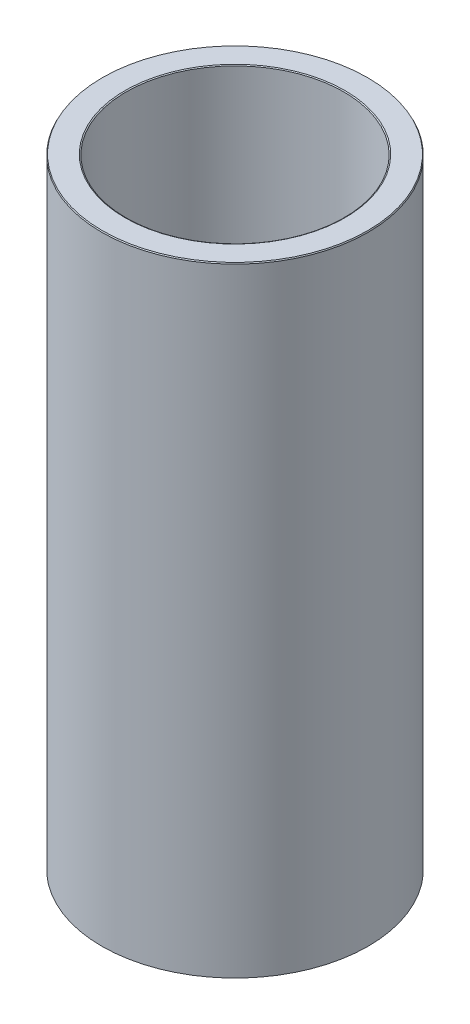
ISO-10303-21;
HEADER;
FILE_DESCRIPTION(('STEP AP214'),'2;1');
FILE_NAME('part.step','',(''),(''),'','','');
FILE_SCHEMA(('AUTOMOTIVE_DESIGN { 1 0 10303 214 1 1 1 1 }'));
ENDSEC;
DATA;
#1=APPLICATION_CONTEXT('core data for automotive mechanical design processes');
#2=APPLICATION_PROTOCOL_DEFINITION('international standard','automotive_design',2000,#1);
#3=PRODUCT_CONTEXT('',#1,'mechanical');
#4=PRODUCT('Part','Part','',(#3));
#5=PRODUCT_RELATED_PRODUCT_CATEGORY('part','',(#4));
#6=PRODUCT_DEFINITION_FORMATION('','',#4);
#7=PRODUCT_DEFINITION_CONTEXT('part definition',#1,'design');
#8=PRODUCT_DEFINITION('design','',#6,#7);
#9=PRODUCT_DEFINITION_SHAPE('','',#8);
#10=(LENGTH_UNIT() NAMED_UNIT(*) SI_UNIT(.MILLI.,.METRE.));
#11=(NAMED_UNIT(*) PLANE_ANGLE_UNIT() SI_UNIT($,.RADIAN.));
#12=(NAMED_UNIT(*) SI_UNIT($,.STERADIAN.) SOLID_ANGLE_UNIT());
#13=UNCERTAINTY_MEASURE_WITH_UNIT(LENGTH_MEASURE(1.E-05),#10,'distance_accuracy_value','');
#14=(GEOMETRIC_REPRESENTATION_CONTEXT(3) GLOBAL_UNCERTAINTY_ASSIGNED_CONTEXT((#13)) GLOBAL_UNIT_ASSIGNED_CONTEXT((#10,
#11,#12)) REPRESENTATION_CONTEXT('',''));
#15=CARTESIAN_POINT('',(0.,0.,0.));
#16=DIRECTION('',(0.,0.,1.));
#17=DIRECTION('',(1.,0.,0.));
#18=AXIS2_PLACEMENT_3D('',#15,#16,#17);
#19=CARTESIAN_POINT('',(0.,162.881200185796,0.));
#20=DIRECTION('',(0.,-1.,0.));
#21=DIRECTION('',(0.,0.,-1.));
#22=AXIS2_PLACEMENT_3D('',#19,#20,#21);
#23=CYLINDRICAL_SURFACE('',#22,35.);
#24=CARTESIAN_POINT('',(0.,0.167708947853312,0.));
#25=DIRECTION('',(0.,1.,0.));
#26=DIRECTION('',(0.,0.,1.));
#27=AXIS2_PLACEMENT_3D('',#24,#25,#26);
#28=CIRCLE('',#27,35.);
#29=CARTESIAN_POINT('',(0.,0.167708947853312,35.));
#30=VERTEX_POINT('',#29);
#31=EDGE_CURVE('E10',#30,#30,#28,.T.);
#32=ORIENTED_EDGE('',*,*,#31,.T.);
#33=EDGE_LOOP('',(#32));
#34=FACE_BOUND('',#33,.T.);
#35=CARTESIAN_POINT('',(0.,162.593699145272,0.));
#36=DIRECTION('',(0.,1.,0.));
#37=DIRECTION('',(0.,0.,1.));
#38=AXIS2_PLACEMENT_3D('',#35,#36,#37);
#39=CIRCLE('',#38,35.);
#40=CARTESIAN_POINT('',(0.,162.593699145272,35.));
#41=VERTEX_POINT('',#40);
#42=EDGE_CURVE('E50',#41,#41,#39,.F.);
#43=ORIENTED_EDGE('',*,*,#42,.T.);
#44=EDGE_LOOP('',(#43));
#45=FACE_BOUND('',#44,.T.);
#46=ADVANCED_FACE('F39',(#34,#45),#23,.T.);
#47=CARTESIAN_POINT('',(0.,162.881200185796,0.));
#48=DIRECTION('',(0.,1.,0.));
#49=DIRECTION('',(0.,0.,1.));
#50=AXIS2_PLACEMENT_3D('',#47,#48,#49);
#51=PLANE('',#50);
#52=CARTESIAN_POINT('',(0.,162.881200185796,0.));
#53=DIRECTION('',(0.,1.,0.));
#54=DIRECTION('',(0.,0.,1.));
#55=AXIS2_PLACEMENT_3D('',#52,#53,#54);
#56=CIRCLE('',#55,28.9256438677759);
#57=CARTESIAN_POINT('',(0.,162.881200185796,28.9256438677759));
#58=VERTEX_POINT('',#57);
#59=EDGE_CURVE('E58',#58,#58,#56,.F.);
#60=ORIENTED_EDGE('',*,*,#59,.T.);
#61=EDGE_LOOP('',(#60));
#62=FACE_BOUND('',#61,.T.);
#63=CARTESIAN_POINT('',(0.,162.881200185796,0.));
#64=DIRECTION('',(0.,1.,0.));
#65=DIRECTION('',(0.,0.,1.));
#66=AXIS2_PLACEMENT_3D('',#63,#64,#65);
#67=CIRCLE('',#66,34.8322910521467);
#68=CARTESIAN_POINT('',(0.,162.881200185796,34.8322910521467));
#69=VERTEX_POINT('',#68);
#70=EDGE_CURVE('E61',#69,#69,#67,.T.);
#71=ORIENTED_EDGE('',*,*,#70,.T.);
#72=EDGE_LOOP('',(#71));
#73=FACE_BOUND('',#72,.T.);
#74=ADVANCED_FACE('F88',(#62,#73),#51,.T.);
#75=CARTESIAN_POINT('',(0.,0.,0.));
#76=DIRECTION('',(0.,1.,0.));
#77=DIRECTION('',(0.,0.,1.));
#78=AXIS2_PLACEMENT_3D('',#75,#76,#77);
#79=PLANE('',#78);
#80=CARTESIAN_POINT('',(0.,0.,0.));
#81=DIRECTION('',(0.,1.,0.));
#82=DIRECTION('',(0.,0.,1.));
#83=AXIS2_PLACEMENT_3D('',#80,#81,#82);
#84=CIRCLE('',#83,28.805851775105);
#85=CARTESIAN_POINT('',(0.,0.,28.805851775105));
#86=VERTEX_POINT('',#85);
#87=EDGE_CURVE('E51',#86,#86,#84,.T.);
#88=ORIENTED_EDGE('',*,*,#87,.T.);
#89=EDGE_LOOP('',(#88));
#90=FACE_BOUND('',#89,.T.);
#91=CARTESIAN_POINT('',(0.,0.,0.));
#92=DIRECTION('',(0.,1.,0.));
#93=DIRECTION('',(0.,0.,1.));
#94=AXIS2_PLACEMENT_3D('',#91,#92,#93);
#95=CIRCLE('',#94,34.7124989594757);
#96=CARTESIAN_POINT('',(0.,0.,34.7124989594757));
#97=VERTEX_POINT('',#96);
#98=EDGE_CURVE('E54',#97,#97,#95,.F.);
#99=ORIENTED_EDGE('',*,*,#98,.T.);
#100=EDGE_LOOP('',(#99));
#101=FACE_BOUND('',#100,.T.);
#102=ADVANCED_FACE('F83',(#90,#101),#79,.F.);
#103=CARTESIAN_POINT('',(0.,162.881200185796,0.));
#104=DIRECTION('',(0.,-1.,0.));
#105=DIRECTION('',(0.,0.,-1.));
#106=AXIS2_PLACEMENT_3D('',#103,#104,#105);
#107=CYLINDRICAL_SURFACE('',#106,28.6381428272516);
#108=CARTESIAN_POINT('',(0.,162.713491237943,0.));
#109=DIRECTION('',(0.,1.,0.));
#110=DIRECTION('',(0.,0.,1.));
#111=AXIS2_PLACEMENT_3D('',#108,#109,#110);
#112=CIRCLE('',#111,28.6381428272516);
#113=CARTESIAN_POINT('',(0.,162.713491237943,28.6381428272516));
#114=VERTEX_POINT('',#113);
#115=EDGE_CURVE('E67',#114,#114,#112,.T.);
#116=ORIENTED_EDGE('',*,*,#115,.T.);
#117=EDGE_LOOP('',(#116));
#118=FACE_BOUND('',#117,.T.);
#119=CARTESIAN_POINT('',(0.,0.287501040524274,0.));
#120=DIRECTION('',(0.,1.,0.));
#121=DIRECTION('',(0.,0.,1.));
#122=AXIS2_PLACEMENT_3D('',#119,#120,#121);
#123=CIRCLE('',#122,28.6381428272516);
#124=CARTESIAN_POINT('',(0.,0.287501040524274,28.6381428272516));
#125=VERTEX_POINT('',#124);
#126=EDGE_CURVE('E69',#125,#125,#123,.F.);
#127=ORIENTED_EDGE('',*,*,#126,.T.);
#128=EDGE_LOOP('',(#127));
#129=FACE_BOUND('',#128,.T.);
#130=ADVANCED_FACE('F71',(#118,#129),#107,.F.);
#131=CARTESIAN_POINT('',(0.,162.713491237943,0.));
#132=DIRECTION('',(0.,1.,0.));
#133=DIRECTION('',(0.,0.,1.));
#134=AXIS2_PLACEMENT_3D('',#131,#132,#133);
#135=CONICAL_SURFACE('',#134,28.6381428272516,1.04272185878151);
#136=ORIENTED_EDGE('',*,*,#59,.F.);
#137=EDGE_LOOP('',(#136));
#138=FACE_BOUND('',#137,.T.);
#139=ORIENTED_EDGE('',*,*,#115,.F.);
#140=EDGE_LOOP('',(#139));
#141=FACE_BOUND('',#140,.T.);
#142=ADVANCED_FACE('F77',(#138,#141),#135,.F.);
#143=CARTESIAN_POINT('',(0.,0.,0.));
#144=DIRECTION('',(0.,-1.,0.));
#145=DIRECTION('',(0.,0.,-1.));
#146=AXIS2_PLACEMENT_3D('',#143,#144,#145);
#147=CONICAL_SURFACE('',#146,28.805851775105,0.528074468013411);
#148=ORIENTED_EDGE('',*,*,#126,.F.);
#149=EDGE_LOOP('',(#148));
#150=FACE_BOUND('',#149,.T.);
#151=ORIENTED_EDGE('',*,*,#87,.F.);
#152=EDGE_LOOP('',(#151));
#153=FACE_BOUND('',#152,.T.);
#154=ADVANCED_FACE('F73',(#150,#153),#147,.F.);
#155=CARTESIAN_POINT('',(0.,0.167708947853312,0.));
#156=DIRECTION('',(0.,1.,0.));
#157=DIRECTION('',(0.,0.,1.));
#158=AXIS2_PLACEMENT_3D('',#155,#156,#157);
#159=CONICAL_SURFACE('',#158,35.,1.04272185878154);
#160=ORIENTED_EDGE('',*,*,#98,.F.);
#161=EDGE_LOOP('',(#160));
#162=FACE_BOUND('',#161,.T.);
#163=ORIENTED_EDGE('',*,*,#31,.F.);
#164=EDGE_LOOP('',(#163));
#165=FACE_BOUND('',#164,.T.);
#166=ADVANCED_FACE('F76',(#162,#165),#159,.T.);
#167=CARTESIAN_POINT('',(0.,162.881200185796,0.));
#168=DIRECTION('',(0.,-1.,0.));
#169=DIRECTION('',(0.,0.,-1.));
#170=AXIS2_PLACEMENT_3D('',#167,#168,#169);
#171=CONICAL_SURFACE('',#170,34.8322910521467,0.528074468013414);
#172=ORIENTED_EDGE('',*,*,#42,.F.);
#173=EDGE_LOOP('',(#172));
#174=FACE_BOUND('',#173,.T.);
#175=ORIENTED_EDGE('',*,*,#70,.F.);
#176=EDGE_LOOP('',(#175));
#177=FACE_BOUND('',#176,.T.);
#178=ADVANCED_FACE('F45',(#174,#177),#171,.T.);
#179=CLOSED_SHELL('',(#46,#74,#102,#130,#142,#154,#166,#178));
#180=MANIFOLD_SOLID_BREP('B2',#179);
#181=ADVANCED_BREP_SHAPE_REPRESENTATION('',(#18,#180),#14);
#182=SHAPE_DEFINITION_REPRESENTATION(#9,#181);
ENDSEC;
END-ISO-10303-21;
